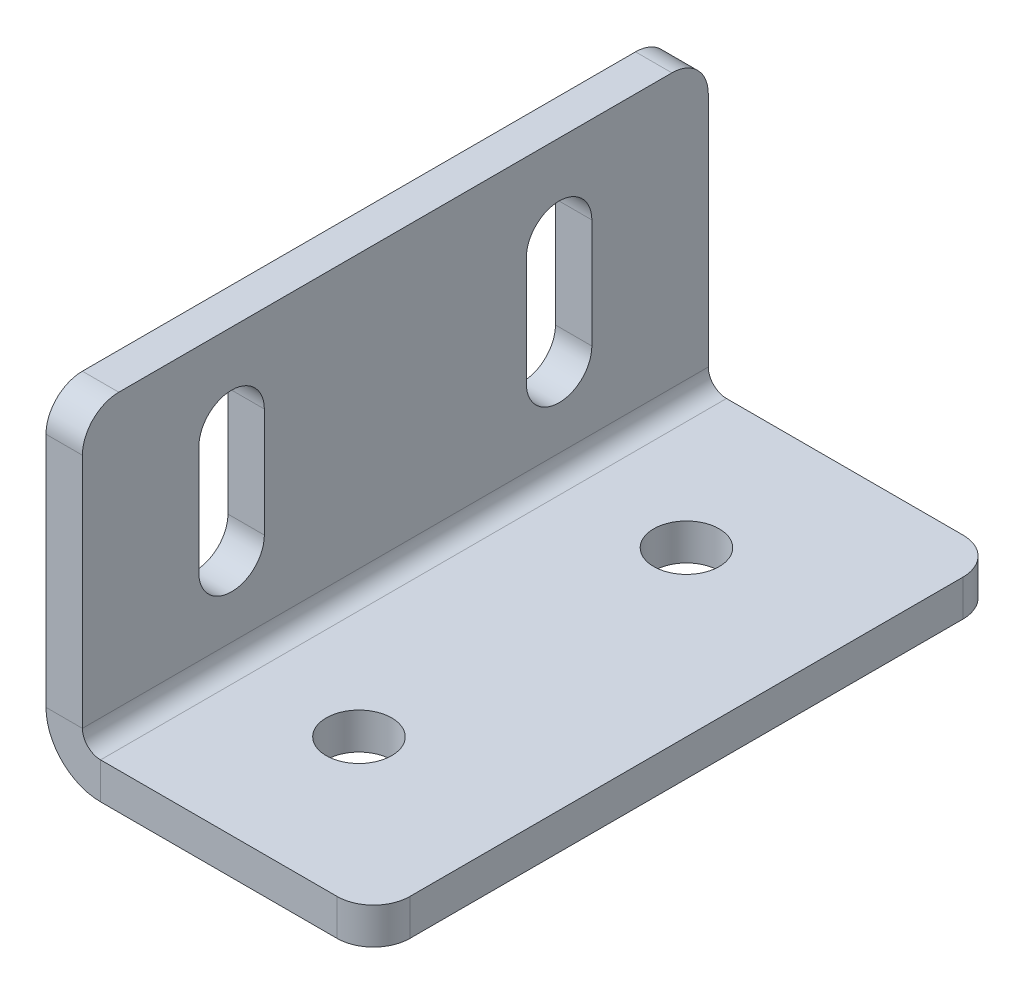
ISO-10303-21;
HEADER;
FILE_DESCRIPTION(('STEP AP214'),'2;1');
FILE_NAME('part.step','',(''),(''),'','','');
FILE_SCHEMA(('AUTOMOTIVE_DESIGN { 1 0 10303 214 1 1 1 1 }'));
ENDSEC;
DATA;
#1=APPLICATION_CONTEXT('core data for automotive mechanical design processes');
#2=APPLICATION_PROTOCOL_DEFINITION('international standard','automotive_design',2000,#1);
#3=PRODUCT_CONTEXT('',#1,'mechanical');
#4=PRODUCT('Part','Part','',(#3));
#5=PRODUCT_RELATED_PRODUCT_CATEGORY('part','',(#4));
#6=PRODUCT_DEFINITION_FORMATION('','',#4);
#7=PRODUCT_DEFINITION_CONTEXT('part definition',#1,'design');
#8=PRODUCT_DEFINITION('design','',#6,#7);
#9=PRODUCT_DEFINITION_SHAPE('','',#8);
#10=(LENGTH_UNIT() NAMED_UNIT(*) SI_UNIT(.MILLI.,.METRE.));
#11=(NAMED_UNIT(*) PLANE_ANGLE_UNIT() SI_UNIT($,.RADIAN.));
#12=(NAMED_UNIT(*) SI_UNIT($,.STERADIAN.) SOLID_ANGLE_UNIT());
#13=UNCERTAINTY_MEASURE_WITH_UNIT(LENGTH_MEASURE(1.E-05),#10,'distance_accuracy_value','');
#14=(GEOMETRIC_REPRESENTATION_CONTEXT(3) GLOBAL_UNCERTAINTY_ASSIGNED_CONTEXT((#13)) GLOBAL_UNIT_ASSIGNED_CONTEXT((#10,
#11,#12)) REPRESENTATION_CONTEXT('',''));
#15=CARTESIAN_POINT('',(0.,0.,0.));
#16=DIRECTION('',(0.,0.,1.));
#17=DIRECTION('',(1.,0.,0.));
#18=AXIS2_PLACEMENT_3D('',#15,#16,#17);
#19=CARTESIAN_POINT('',(0.,18.,-22.5));
#20=DIRECTION('',(-1.,0.,0.));
#21=DIRECTION('',(0.,0.,1.));
#22=AXIS2_PLACEMENT_3D('',#19,#20,#21);
#23=CYLINDRICAL_SURFACE('',#22,4.5);
#24=CARTESIAN_POINT('',(5.,18.,-22.5));
#25=DIRECTION('',(1.,0.,0.));
#26=DIRECTION('',(0.,0.,-1.));
#27=AXIS2_PLACEMENT_3D('',#24,#25,#26);
#28=CIRCLE('',#27,4.5);
#29=CARTESIAN_POINT('',(5.,18.,-18.));
#30=VERTEX_POINT('',#29);
#31=CARTESIAN_POINT('',(5.,18.,-27.));
#32=VERTEX_POINT('',#31);
#33=EDGE_CURVE('E351',#30,#32,#28,.T.);
#34=ORIENTED_EDGE('',*,*,#33,.T.);
#35=DIRECTION('',(1.,0.,0.));
#36=VECTOR('',#35,1.);
#37=CARTESIAN_POINT('',(0.,18.,-27.));
#38=LINE('',#37,#36);
#39=CARTESIAN_POINT('',(0.,18.,-27.));
#40=VERTEX_POINT('',#39);
#41=EDGE_CURVE('E255',#40,#32,#38,.T.);
#42=ORIENTED_EDGE('',*,*,#41,.F.);
#43=CARTESIAN_POINT('',(0.,18.,-22.5));
#44=DIRECTION('',(1.,0.,0.));
#45=DIRECTION('',(0.,0.,-1.));
#46=AXIS2_PLACEMENT_3D('',#43,#44,#45);
#47=CIRCLE('',#46,4.5);
#48=CARTESIAN_POINT('',(0.,18.,-18.));
#49=VERTEX_POINT('',#48);
#50=EDGE_CURVE('E264',#49,#40,#47,.T.);
#51=ORIENTED_EDGE('',*,*,#50,.F.);
#52=DIRECTION('',(1.,0.,0.));
#53=VECTOR('',#52,1.);
#54=CARTESIAN_POINT('',(0.,18.,-18.));
#55=LINE('',#54,#53);
#56=EDGE_CURVE('E258',#49,#30,#55,.T.);
#57=ORIENTED_EDGE('',*,*,#56,.T.);
#58=EDGE_LOOP('',(#34,#42,#51,#57));
#59=FACE_BOUND('',#58,.T.);
#60=ADVANCED_FACE('F46',(#59),#23,.F.);
#61=CARTESIAN_POINT('',(0.,18.,22.5));
#62=DIRECTION('',(-1.,0.,0.));
#63=DIRECTION('',(0.,0.,1.));
#64=AXIS2_PLACEMENT_3D('',#61,#62,#63);
#65=CYLINDRICAL_SURFACE('',#64,4.5);
#66=CARTESIAN_POINT('',(5.,18.,22.5));
#67=DIRECTION('',(1.,0.,0.));
#68=DIRECTION('',(0.,0.,-1.));
#69=AXIS2_PLACEMENT_3D('',#66,#67,#68);
#70=CIRCLE('',#69,4.5);
#71=CARTESIAN_POINT('',(5.,18.,27.));
#72=VERTEX_POINT('',#71);
#73=CARTESIAN_POINT('',(5.,18.,18.));
#74=VERTEX_POINT('',#73);
#75=EDGE_CURVE('E361',#72,#74,#70,.T.);
#76=ORIENTED_EDGE('',*,*,#75,.T.);
#77=DIRECTION('',(1.,0.,0.));
#78=VECTOR('',#77,1.);
#79=CARTESIAN_POINT('',(0.,18.,18.));
#80=LINE('',#79,#78);
#81=CARTESIAN_POINT('',(0.,18.,18.));
#82=VERTEX_POINT('',#81);
#83=EDGE_CURVE('E226',#82,#74,#80,.T.);
#84=ORIENTED_EDGE('',*,*,#83,.F.);
#85=CARTESIAN_POINT('',(0.,18.,22.5));
#86=DIRECTION('',(1.,0.,0.));
#87=DIRECTION('',(0.,0.,-1.));
#88=AXIS2_PLACEMENT_3D('',#85,#86,#87);
#89=CIRCLE('',#88,4.5);
#90=CARTESIAN_POINT('',(0.,18.,27.));
#91=VERTEX_POINT('',#90);
#92=EDGE_CURVE('E268',#91,#82,#89,.T.);
#93=ORIENTED_EDGE('',*,*,#92,.F.);
#94=DIRECTION('',(1.,0.,0.));
#95=VECTOR('',#94,1.);
#96=CARTESIAN_POINT('',(0.,18.,27.));
#97=LINE('',#96,#95);
#98=EDGE_CURVE('E191',#91,#72,#97,.T.);
#99=ORIENTED_EDGE('',*,*,#98,.T.);
#100=EDGE_LOOP('',(#76,#84,#93,#99));
#101=FACE_BOUND('',#100,.T.);
#102=ADVANCED_FACE('F507',(#101),#65,.F.);
#103=CARTESIAN_POINT('',(0.,0.,43.));
#104=DIRECTION('',(0.,0.,-1.));
#105=DIRECTION('',(0.,-1.,0.));
#106=AXIS2_PLACEMENT_3D('',#103,#104,#105);
#107=PLANE('',#106);
#108=DIRECTION('',(0.,1.,0.));
#109=VECTOR('',#108,1.);
#110=CARTESIAN_POINT('',(5.,0.,43.));
#111=LINE('',#110,#109);
#112=CARTESIAN_POINT('',(5.,40.,43.));
#113=VERTEX_POINT('',#112);
#114=CARTESIAN_POINT('',(5.,7.5,43.));
#115=VERTEX_POINT('',#114);
#116=EDGE_CURVE('E358',#113,#115,#111,.F.);
#117=ORIENTED_EDGE('',*,*,#116,.F.);
#118=DIRECTION('',(1.,0.,0.));
#119=VECTOR('',#118,1.);
#120=CARTESIAN_POINT('',(0.,40.,43.));
#121=LINE('',#120,#119);
#122=CARTESIAN_POINT('',(0.,40.,43.));
#123=VERTEX_POINT('',#122);
#124=EDGE_CURVE('E11',#113,#123,#121,.F.);
#125=ORIENTED_EDGE('',*,*,#124,.T.);
#126=DIRECTION('',(0.,-1.,0.));
#127=VECTOR('',#126,1.);
#128=CARTESIAN_POINT('',(0.,0.,43.));
#129=LINE('',#128,#127);
#130=CARTESIAN_POINT('',(0.,7.5,43.));
#131=VERTEX_POINT('',#130);
#132=EDGE_CURVE('E272',#123,#131,#129,.T.);
#133=ORIENTED_EDGE('',*,*,#132,.T.);
#134=DIRECTION('',(-1.,0.,0.));
#135=VECTOR('',#134,1.);
#136=CARTESIAN_POINT('',(0.,7.5,43.));
#137=LINE('',#136,#135);
#138=EDGE_CURVE('E378',#115,#131,#137,.T.);
#139=ORIENTED_EDGE('',*,*,#138,.F.);
#140=EDGE_LOOP('',(#117,#125,#133,#139));
#141=FACE_BOUND('',#140,.T.);
#142=ADVANCED_FACE('F464',(#141),#107,.F.);
#143=CARTESIAN_POINT('',(0.,45.,-43.));
#144=DIRECTION('',(0.,-1.,0.));
#145=DIRECTION('',(0.,0.,1.));
#146=AXIS2_PLACEMENT_3D('',#143,#144,#145);
#147=PLANE('',#146);
#148=DIRECTION('',(0.,0.,1.));
#149=VECTOR('',#148,1.);
#150=CARTESIAN_POINT('',(5.,45.,-43.));
#151=LINE('',#150,#149);
#152=CARTESIAN_POINT('',(5.,45.,-38.));
#153=VERTEX_POINT('',#152);
#154=CARTESIAN_POINT('',(5.,45.,38.));
#155=VERTEX_POINT('',#154);
#156=EDGE_CURVE('E354',#153,#155,#151,.T.);
#157=ORIENTED_EDGE('',*,*,#156,.F.);
#158=DIRECTION('',(-1.,0.,0.));
#159=VECTOR('',#158,1.);
#160=CARTESIAN_POINT('',(0.,45.,-38.));
#161=LINE('',#160,#159);
#162=CARTESIAN_POINT('',(0.,45.,-38.));
#163=VERTEX_POINT('',#162);
#164=EDGE_CURVE('E413',#153,#163,#161,.T.);
#165=ORIENTED_EDGE('',*,*,#164,.T.);
#166=DIRECTION('',(0.,0.,1.));
#167=VECTOR('',#166,1.);
#168=CARTESIAN_POINT('',(0.,45.,-43.));
#169=LINE('',#168,#167);
#170=CARTESIAN_POINT('',(0.,45.,38.));
#171=VERTEX_POINT('',#170);
#172=EDGE_CURVE('E275',#163,#171,#169,.T.);
#173=ORIENTED_EDGE('',*,*,#172,.T.);
#174=DIRECTION('',(1.,0.,0.));
#175=VECTOR('',#174,1.);
#176=CARTESIAN_POINT('',(0.,45.,38.));
#177=LINE('',#176,#175);
#178=EDGE_CURVE('E410',#171,#155,#177,.T.);
#179=ORIENTED_EDGE('',*,*,#178,.T.);
#180=EDGE_LOOP('',(#157,#165,#173,#179));
#181=FACE_BOUND('',#180,.T.);
#182=ADVANCED_FACE('F442',(#181),#147,.F.);
#183=CARTESIAN_POINT('',(0.,0.,-43.));
#184=DIRECTION('',(0.,0.,-1.));
#185=DIRECTION('',(0.,-1.,0.));
#186=AXIS2_PLACEMENT_3D('',#183,#184,#185);
#187=PLANE('',#186);
#188=DIRECTION('',(0.,-1.,0.));
#189=VECTOR('',#188,1.);
#190=CARTESIAN_POINT('',(0.,0.,-43.));
#191=LINE('',#190,#189);
#192=CARTESIAN_POINT('',(0.,40.,-43.));
#193=VERTEX_POINT('',#192);
#194=CARTESIAN_POINT('',(0.,7.5,-43.));
#195=VERTEX_POINT('',#194);
#196=EDGE_CURVE('E279',#193,#195,#191,.T.);
#197=ORIENTED_EDGE('',*,*,#196,.F.);
#198=DIRECTION('',(1.,0.,0.));
#199=VECTOR('',#198,1.);
#200=CARTESIAN_POINT('',(0.,40.,-43.));
#201=LINE('',#200,#199);
#202=CARTESIAN_POINT('',(5.,40.,-43.));
#203=VERTEX_POINT('',#202);
#204=EDGE_CURVE('E423',#193,#203,#201,.T.);
#205=ORIENTED_EDGE('',*,*,#204,.T.);
#206=DIRECTION('',(0.,1.,0.));
#207=VECTOR('',#206,1.);
#208=CARTESIAN_POINT('',(5.,0.,-43.));
#209=LINE('',#208,#207);
#210=CARTESIAN_POINT('',(5.,7.5,-43.));
#211=VERTEX_POINT('',#210);
#212=EDGE_CURVE('E332',#203,#211,#209,.F.);
#213=ORIENTED_EDGE('',*,*,#212,.T.);
#214=DIRECTION('',(-1.,0.,0.));
#215=VECTOR('',#214,1.);
#216=CARTESIAN_POINT('',(0.,7.5,-43.));
#217=LINE('',#216,#215);
#218=EDGE_CURVE('E374',#211,#195,#217,.T.);
#219=ORIENTED_EDGE('',*,*,#218,.T.);
#220=EDGE_LOOP('',(#197,#205,#213,#219));
#221=FACE_BOUND('',#220,.T.);
#222=ADVANCED_FACE('F449',(#221),#187,.T.);
#223=CARTESIAN_POINT('',(7.5,7.5,-43.));
#224=DIRECTION('',(0.,0.,1.));
#225=DIRECTION('',(1.,0.,0.));
#226=AXIS2_PLACEMENT_3D('',#223,#224,#225);
#227=PLANE('',#226);
#228=ORIENTED_EDGE('',*,*,#218,.F.);
#229=CARTESIAN_POINT('',(7.5,7.5,-43.));
#230=DIRECTION('',(0.,0.,1.));
#231=DIRECTION('',(1.,0.,0.));
#232=AXIS2_PLACEMENT_3D('',#229,#230,#231);
#233=CIRCLE('',#232,2.5);
#234=CARTESIAN_POINT('',(7.5,5.,-43.));
#235=VERTEX_POINT('',#234);
#236=EDGE_CURVE('E347',#211,#235,#233,.T.);
#237=ORIENTED_EDGE('',*,*,#236,.T.);
#238=DIRECTION('',(0.,-1.,0.));
#239=VECTOR('',#238,1.);
#240=CARTESIAN_POINT('',(7.50000000000001,0.,-43.));
#241=LINE('',#240,#239);
#242=CARTESIAN_POINT('',(7.50000000000001,0.,-43.));
#243=VERTEX_POINT('',#242);
#244=EDGE_CURVE('E371',#235,#243,#241,.T.);
#245=ORIENTED_EDGE('',*,*,#244,.T.);
#246=CARTESIAN_POINT('',(7.5,7.5,-43.));
#247=DIRECTION('',(0.,0.,-1.));
#248=DIRECTION('',(-1.,0.,0.));
#249=AXIS2_PLACEMENT_3D('',#246,#247,#248);
#250=CIRCLE('',#249,7.5);
#251=EDGE_CURVE('E269',#195,#243,#250,.F.);
#252=ORIENTED_EDGE('',*,*,#251,.F.);
#253=EDGE_LOOP('',(#228,#237,#245,#252));
#254=FACE_BOUND('',#253,.T.);
#255=ADVANCED_FACE('F454',(#254),#227,.F.);
#256=CARTESIAN_POINT('',(45.,0.,-43.));
#257=DIRECTION('',(0.,0.,-1.));
#258=DIRECTION('',(1.,0.,0.));
#259=AXIS2_PLACEMENT_3D('',#256,#257,#258);
#260=PLANE('',#259);
#261=DIRECTION('',(1.,0.,0.));
#262=VECTOR('',#261,1.);
#263=CARTESIAN_POINT('',(45.,5.,-43.));
#264=LINE('',#263,#262);
#265=CARTESIAN_POINT('',(40.,5.,-43.));
#266=VERTEX_POINT('',#265);
#267=EDGE_CURVE('E326',#235,#266,#264,.T.);
#268=ORIENTED_EDGE('',*,*,#267,.T.);
#269=DIRECTION('',(0.,-1.,0.));
#270=VECTOR('',#269,1.);
#271=CARTESIAN_POINT('',(40.,0.,-43.));
#272=LINE('',#271,#270);
#273=CARTESIAN_POINT('',(40.,0.,-43.));
#274=VERTEX_POINT('',#273);
#275=EDGE_CURVE('E382',#266,#274,#272,.T.);
#276=ORIENTED_EDGE('',*,*,#275,.T.);
#277=DIRECTION('',(1.,0.,0.));
#278=VECTOR('',#277,1.);
#279=CARTESIAN_POINT('',(45.,0.,-43.));
#280=LINE('',#279,#278);
#281=EDGE_CURVE('E298',#243,#274,#280,.T.);
#282=ORIENTED_EDGE('',*,*,#281,.F.);
#283=ORIENTED_EDGE('',*,*,#244,.F.);
#284=EDGE_LOOP('',(#268,#276,#282,#283));
#285=FACE_BOUND('',#284,.T.);
#286=ADVANCED_FACE('F497',(#285),#260,.T.);
#287=CARTESIAN_POINT('',(45.,0.,-43.));
#288=DIRECTION('',(1.,0.,0.));
#289=DIRECTION('',(0.,0.,1.));
#290=AXIS2_PLACEMENT_3D('',#287,#288,#289);
#291=PLANE('',#290);
#292=DIRECTION('',(0.,0.,1.));
#293=VECTOR('',#292,1.);
#294=CARTESIAN_POINT('',(45.,0.,-43.));
#295=LINE('',#294,#293);
#296=CARTESIAN_POINT('',(45.,0.,-38.));
#297=VERTEX_POINT('',#296);
#298=CARTESIAN_POINT('',(45.,0.,38.));
#299=VERTEX_POINT('',#298);
#300=EDGE_CURVE('E290',#297,#299,#295,.T.);
#301=ORIENTED_EDGE('',*,*,#300,.F.);
#302=DIRECTION('',(0.,-1.,0.));
#303=VECTOR('',#302,1.);
#304=CARTESIAN_POINT('',(45.,0.,-38.));
#305=LINE('',#304,#303);
#306=CARTESIAN_POINT('',(45.,5.,-38.));
#307=VERTEX_POINT('',#306);
#308=EDGE_CURVE('E398',#297,#307,#305,.F.);
#309=ORIENTED_EDGE('',*,*,#308,.T.);
#310=DIRECTION('',(0.,0.,1.));
#311=VECTOR('',#310,1.);
#312=CARTESIAN_POINT('',(45.,5.,-43.));
#313=LINE('',#312,#311);
#314=CARTESIAN_POINT('',(45.,5.,38.));
#315=VERTEX_POINT('',#314);
#316=EDGE_CURVE('E336',#307,#315,#313,.T.);
#317=ORIENTED_EDGE('',*,*,#316,.T.);
#318=DIRECTION('',(0.,1.,0.));
#319=VECTOR('',#318,1.);
#320=CARTESIAN_POINT('',(45.,0.,38.));
#321=LINE('',#320,#319);
#322=EDGE_CURVE('E394',#315,#299,#321,.F.);
#323=ORIENTED_EDGE('',*,*,#322,.T.);
#324=EDGE_LOOP('',(#301,#309,#317,#323));
#325=FACE_BOUND('',#324,.T.);
#326=ADVANCED_FACE('F488',(#325),#291,.T.);
#327=CARTESIAN_POINT('',(45.,0.,43.));
#328=DIRECTION('',(0.,0.,-1.));
#329=DIRECTION('',(1.,0.,0.));
#330=AXIS2_PLACEMENT_3D('',#327,#328,#329);
#331=PLANE('',#330);
#332=DIRECTION('',(1.,0.,0.));
#333=VECTOR('',#332,1.);
#334=CARTESIAN_POINT('',(45.,0.,43.));
#335=LINE('',#334,#333);
#336=CARTESIAN_POINT('',(7.50000000000001,0.,43.));
#337=VERTEX_POINT('',#336);
#338=CARTESIAN_POINT('',(40.,0.,43.));
#339=VERTEX_POINT('',#338);
#340=EDGE_CURVE('E294',#337,#339,#335,.T.);
#341=ORIENTED_EDGE('',*,*,#340,.T.);
#342=DIRECTION('',(0.,-1.,0.));
#343=VECTOR('',#342,1.);
#344=CARTESIAN_POINT('',(40.,0.,43.));
#345=LINE('',#344,#343);
#346=CARTESIAN_POINT('',(40.,5.,43.));
#347=VERTEX_POINT('',#346);
#348=EDGE_CURVE('E407',#339,#347,#345,.F.);
#349=ORIENTED_EDGE('',*,*,#348,.T.);
#350=DIRECTION('',(1.,0.,0.));
#351=VECTOR('',#350,1.);
#352=CARTESIAN_POINT('',(45.,5.,43.));
#353=LINE('',#352,#351);
#354=CARTESIAN_POINT('',(7.50000000000001,5.,43.));
#355=VERTEX_POINT('',#354);
#356=EDGE_CURVE('E337',#355,#347,#353,.T.);
#357=ORIENTED_EDGE('',*,*,#356,.F.);
#358=DIRECTION('',(0.,-1.,0.));
#359=VECTOR('',#358,1.);
#360=CARTESIAN_POINT('',(7.50000000000001,0.,43.));
#361=LINE('',#360,#359);
#362=EDGE_CURVE('E310',#355,#337,#361,.T.);
#363=ORIENTED_EDGE('',*,*,#362,.T.);
#364=EDGE_LOOP('',(#341,#349,#357,#363));
#365=FACE_BOUND('',#364,.T.);
#366=ADVANCED_FACE('F475',(#365),#331,.F.);
#367=CARTESIAN_POINT('',(22.5,0.,-22.5));
#368=DIRECTION('',(0.,-1.,0.));
#369=DIRECTION('',(1.,0.,0.));
#370=AXIS2_PLACEMENT_3D('',#367,#368,#369);
#371=CYLINDRICAL_SURFACE('',#370,4.49999999999999);
#372=CARTESIAN_POINT('',(22.5,0.,-22.5));
#373=DIRECTION('',(0.,-1.,0.));
#374=DIRECTION('',(0.,0.,-1.));
#375=AXIS2_PLACEMENT_3D('',#372,#373,#374);
#376=CIRCLE('',#375,4.49999999999999);
#377=CARTESIAN_POINT('',(22.5,0.,-27.));
#378=VERTEX_POINT('',#377);
#379=EDGE_CURVE('E282',#378,#378,#376,.T.);
#380=ORIENTED_EDGE('',*,*,#379,.T.);
#381=EDGE_LOOP('',(#380));
#382=FACE_BOUND('',#381,.T.);
#383=CARTESIAN_POINT('',(22.5,5.,-22.5));
#384=DIRECTION('',(0.,-1.,0.));
#385=DIRECTION('',(0.,0.,-1.));
#386=AXIS2_PLACEMENT_3D('',#383,#384,#385);
#387=CIRCLE('',#386,4.49999999999999);
#388=CARTESIAN_POINT('',(22.5,5.,-27.));
#389=VERTEX_POINT('',#388);
#390=EDGE_CURVE('E327',#389,#389,#387,.T.);
#391=ORIENTED_EDGE('',*,*,#390,.F.);
#392=EDGE_LOOP('',(#391));
#393=FACE_BOUND('',#392,.T.);
#394=ADVANCED_FACE('F555',(#382,#393),#371,.F.);
#395=CARTESIAN_POINT('',(22.5,0.,22.5));
#396=DIRECTION('',(0.,-1.,0.));
#397=DIRECTION('',(1.,0.,0.));
#398=AXIS2_PLACEMENT_3D('',#395,#396,#397);
#399=CYLINDRICAL_SURFACE('',#398,4.49999999999999);
#400=CARTESIAN_POINT('',(22.5,0.,22.5));
#401=DIRECTION('',(0.,-1.,0.));
#402=DIRECTION('',(0.,0.,-1.));
#403=AXIS2_PLACEMENT_3D('',#400,#401,#402);
#404=CIRCLE('',#403,4.49999999999999);
#405=CARTESIAN_POINT('',(22.5,0.,18.));
#406=VERTEX_POINT('',#405);
#407=EDGE_CURVE('E286',#406,#406,#404,.T.);
#408=ORIENTED_EDGE('',*,*,#407,.T.);
#409=EDGE_LOOP('',(#408));
#410=FACE_BOUND('',#409,.T.);
#411=CARTESIAN_POINT('',(22.5,5.,22.5));
#412=DIRECTION('',(0.,-1.,0.));
#413=DIRECTION('',(0.,0.,-1.));
#414=AXIS2_PLACEMENT_3D('',#411,#412,#413);
#415=CIRCLE('',#414,4.49999999999999);
#416=CARTESIAN_POINT('',(22.5,5.,18.));
#417=VERTEX_POINT('',#416);
#418=EDGE_CURVE('E331',#417,#417,#415,.T.);
#419=ORIENTED_EDGE('',*,*,#418,.F.);
#420=EDGE_LOOP('',(#419));
#421=FACE_BOUND('',#420,.T.);
#422=ADVANCED_FACE('F558',(#410,#421),#399,.F.);
#423=CARTESIAN_POINT('',(7.5,7.5,43.));
#424=DIRECTION('',(0.,0.,-1.));
#425=DIRECTION('',(-1.,0.,0.));
#426=AXIS2_PLACEMENT_3D('',#423,#424,#425);
#427=PLANE('',#426);
#428=CARTESIAN_POINT('',(7.5,7.5,43.));
#429=DIRECTION('',(0.,0.,1.));
#430=DIRECTION('',(1.,0.,0.));
#431=AXIS2_PLACEMENT_3D('',#428,#429,#430);
#432=CIRCLE('',#431,2.5);
#433=EDGE_CURVE('E225',#355,#115,#432,.F.);
#434=ORIENTED_EDGE('',*,*,#433,.T.);
#435=ORIENTED_EDGE('',*,*,#138,.T.);
#436=CARTESIAN_POINT('',(7.5,7.5,43.));
#437=DIRECTION('',(0.,0.,1.));
#438=DIRECTION('',(1.,0.,0.));
#439=AXIS2_PLACEMENT_3D('',#436,#437,#438);
#440=CIRCLE('',#439,7.5);
#441=EDGE_CURVE('E311',#337,#131,#440,.F.);
#442=ORIENTED_EDGE('',*,*,#441,.F.);
#443=ORIENTED_EDGE('',*,*,#362,.F.);
#444=EDGE_LOOP('',(#434,#435,#442,#443));
#445=FACE_BOUND('',#444,.T.);
#446=ADVANCED_FACE('F467',(#445),#427,.F.);
#447=CARTESIAN_POINT('',(45.,0.,-43.));
#448=DIRECTION('',(0.,-1.,0.));
#449=DIRECTION('',(1.,0.,0.));
#450=AXIS2_PLACEMENT_3D('',#447,#448,#449);
#451=PLANE('',#450);
#452=ORIENTED_EDGE('',*,*,#379,.F.);
#453=EDGE_LOOP('',(#452));
#454=FACE_BOUND('',#453,.T.);
#455=ORIENTED_EDGE('',*,*,#407,.F.);
#456=EDGE_LOOP('',(#455));
#457=FACE_BOUND('',#456,.T.);
#458=ORIENTED_EDGE('',*,*,#281,.T.);
#459=CARTESIAN_POINT('',(40.,0.,-38.));
#460=DIRECTION('',(0.,-1.,0.));
#461=DIRECTION('',(1.,0.,0.));
#462=AXIS2_PLACEMENT_3D('',#459,#460,#461);
#463=CIRCLE('',#462,5.);
#464=EDGE_CURVE('E391',#274,#297,#463,.T.);
#465=ORIENTED_EDGE('',*,*,#464,.T.);
#466=ORIENTED_EDGE('',*,*,#300,.T.);
#467=CARTESIAN_POINT('',(40.,0.,38.));
#468=DIRECTION('',(0.,-1.,0.));
#469=DIRECTION('',(1.,0.,0.));
#470=AXIS2_PLACEMENT_3D('',#467,#468,#469);
#471=CIRCLE('',#470,5.);
#472=EDGE_CURVE('E388',#299,#339,#471,.T.);
#473=ORIENTED_EDGE('',*,*,#472,.T.);
#474=ORIENTED_EDGE('',*,*,#340,.F.);
#475=DIRECTION('',(0.,0.,1.));
#476=VECTOR('',#475,1.);
#477=CARTESIAN_POINT('',(7.5,0.,-43.));
#478=LINE('',#477,#476);
#479=EDGE_CURVE('E306',#337,#243,#478,.F.);
#480=ORIENTED_EDGE('',*,*,#479,.T.);
#481=EDGE_LOOP('',(#458,#465,#466,#473,#474,#480));
#482=FACE_BOUND('',#481,.T.);
#483=ADVANCED_FACE('F491',(#454,#457,#482),#451,.T.);
#484=CARTESIAN_POINT('',(0.,0.,-43.));
#485=DIRECTION('',(-1.,0.,0.));
#486=DIRECTION('',(0.,0.,1.));
#487=AXIS2_PLACEMENT_3D('',#484,#485,#486);
#488=PLANE('',#487);
#489=DIRECTION('',(0.,1.,0.));
#490=VECTOR('',#489,1.);
#491=CARTESIAN_POINT('',(0.,33.,18.));
#492=LINE('',#491,#490);
#493=CARTESIAN_POINT('',(0.,33.,18.));
#494=VERTEX_POINT('',#493);
#495=EDGE_CURVE('E192',#82,#494,#492,.T.);
#496=ORIENTED_EDGE('',*,*,#495,.T.);
#497=CARTESIAN_POINT('',(0.,33.,22.5));
#498=DIRECTION('',(1.,0.,0.));
#499=DIRECTION('',(0.,0.,-1.));
#500=AXIS2_PLACEMENT_3D('',#497,#498,#499);
#501=CIRCLE('',#500,4.49999999999999);
#502=CARTESIAN_POINT('',(0.,33.,27.));
#503=VERTEX_POINT('',#502);
#504=EDGE_CURVE('E186',#494,#503,#501,.T.);
#505=ORIENTED_EDGE('',*,*,#504,.T.);
#506=DIRECTION('',(0.,-1.,0.));
#507=VECTOR('',#506,1.);
#508=CARTESIAN_POINT('',(0.,33.,27.));
#509=LINE('',#508,#507);
#510=EDGE_CURVE('E195',#503,#91,#509,.T.);
#511=ORIENTED_EDGE('',*,*,#510,.T.);
#512=ORIENTED_EDGE('',*,*,#92,.T.);
#513=EDGE_LOOP('',(#496,#505,#511,#512));
#514=FACE_BOUND('',#513,.T.);
#515=DIRECTION('',(0.,1.,0.));
#516=VECTOR('',#515,1.);
#517=CARTESIAN_POINT('',(0.,33.,-27.));
#518=LINE('',#517,#516);
#519=CARTESIAN_POINT('',(0.,33.,-27.));
#520=VERTEX_POINT('',#519);
#521=EDGE_CURVE('E240',#40,#520,#518,.T.);
#522=ORIENTED_EDGE('',*,*,#521,.T.);
#523=CARTESIAN_POINT('',(0.,33.,-22.5));
#524=DIRECTION('',(1.,0.,0.));
#525=DIRECTION('',(0.,0.,-1.));
#526=AXIS2_PLACEMENT_3D('',#523,#524,#525);
#527=CIRCLE('',#526,4.49999999999999);
#528=CARTESIAN_POINT('',(0.,33.,-18.));
#529=VERTEX_POINT('',#528);
#530=EDGE_CURVE('E231',#520,#529,#527,.T.);
#531=ORIENTED_EDGE('',*,*,#530,.T.);
#532=DIRECTION('',(0.,-1.,0.));
#533=VECTOR('',#532,1.);
#534=CARTESIAN_POINT('',(0.,33.,-18.));
#535=LINE('',#534,#533);
#536=EDGE_CURVE('E235',#529,#49,#535,.T.);
#537=ORIENTED_EDGE('',*,*,#536,.T.);
#538=ORIENTED_EDGE('',*,*,#50,.T.);
#539=EDGE_LOOP('',(#522,#531,#537,#538));
#540=FACE_BOUND('',#539,.T.);
#541=ORIENTED_EDGE('',*,*,#172,.F.);
#542=CARTESIAN_POINT('',(0.,40.,-38.));
#543=DIRECTION('',(-1.,0.,0.));
#544=DIRECTION('',(0.,0.,1.));
#545=AXIS2_PLACEMENT_3D('',#542,#543,#544);
#546=CIRCLE('',#545,5.);
#547=EDGE_CURVE('E420',#163,#193,#546,.T.);
#548=ORIENTED_EDGE('',*,*,#547,.T.);
#549=ORIENTED_EDGE('',*,*,#196,.T.);
#550=DIRECTION('',(0.,0.,1.));
#551=VECTOR('',#550,1.);
#552=CARTESIAN_POINT('',(0.,7.5,-43.));
#553=LINE('',#552,#551);
#554=EDGE_CURVE('E302',#195,#131,#553,.T.);
#555=ORIENTED_EDGE('',*,*,#554,.T.);
#556=ORIENTED_EDGE('',*,*,#132,.F.);
#557=CARTESIAN_POINT('',(0.,40.,38.));
#558=DIRECTION('',(-1.,0.,0.));
#559=DIRECTION('',(0.,0.,1.));
#560=AXIS2_PLACEMENT_3D('',#557,#558,#559);
#561=CIRCLE('',#560,5.);
#562=EDGE_CURVE('E417',#123,#171,#561,.T.);
#563=ORIENTED_EDGE('',*,*,#562,.T.);
#564=EDGE_LOOP('',(#541,#548,#549,#555,#556,#563));
#565=FACE_BOUND('',#564,.T.);
#566=ADVANCED_FACE('F203',(#514,#540,#565),#488,.T.);
#567=CARTESIAN_POINT('',(7.5,7.5,-43.));
#568=DIRECTION('',(0.,0.,1.));
#569=DIRECTION('',(1.,0.,0.));
#570=AXIS2_PLACEMENT_3D('',#567,#568,#569);
#571=CYLINDRICAL_SURFACE('',#570,7.5);
#572=ORIENTED_EDGE('',*,*,#251,.T.);
#573=ORIENTED_EDGE('',*,*,#479,.F.);
#574=ORIENTED_EDGE('',*,*,#441,.T.);
#575=ORIENTED_EDGE('',*,*,#554,.F.);
#576=EDGE_LOOP('',(#572,#573,#574,#575));
#577=FACE_BOUND('',#576,.T.);
#578=ADVANCED_FACE('F458',(#577),#571,.T.);
#579=CARTESIAN_POINT('',(45.,5.,-43.));
#580=DIRECTION('',(0.,-1.,0.));
#581=DIRECTION('',(1.,0.,0.));
#582=AXIS2_PLACEMENT_3D('',#579,#580,#581);
#583=PLANE('',#582);
#584=ORIENTED_EDGE('',*,*,#390,.T.);
#585=EDGE_LOOP('',(#584));
#586=FACE_BOUND('',#585,.T.);
#587=ORIENTED_EDGE('',*,*,#418,.T.);
#588=EDGE_LOOP('',(#587));
#589=FACE_BOUND('',#588,.T.);
#590=ORIENTED_EDGE('',*,*,#316,.F.);
#591=CARTESIAN_POINT('',(40.,5.,-38.));
#592=DIRECTION('',(0.,-1.,0.));
#593=DIRECTION('',(1.,0.,0.));
#594=AXIS2_PLACEMENT_3D('',#591,#592,#593);
#595=CIRCLE('',#594,5.);
#596=EDGE_CURVE('E404',#307,#266,#595,.F.);
#597=ORIENTED_EDGE('',*,*,#596,.T.);
#598=ORIENTED_EDGE('',*,*,#267,.F.);
#599=DIRECTION('',(0.,0.,1.));
#600=VECTOR('',#599,1.);
#601=CARTESIAN_POINT('',(7.50000000000001,5.,-43.));
#602=LINE('',#601,#600);
#603=EDGE_CURVE('E315',#355,#235,#602,.F.);
#604=ORIENTED_EDGE('',*,*,#603,.F.);
#605=ORIENTED_EDGE('',*,*,#356,.T.);
#606=CARTESIAN_POINT('',(40.,5.,38.));
#607=DIRECTION('',(0.,-1.,0.));
#608=DIRECTION('',(1.,0.,0.));
#609=AXIS2_PLACEMENT_3D('',#606,#607,#608);
#610=CIRCLE('',#609,5.);
#611=EDGE_CURVE('E401',#347,#315,#610,.F.);
#612=ORIENTED_EDGE('',*,*,#611,.T.);
#613=EDGE_LOOP('',(#590,#597,#598,#604,#605,#612));
#614=FACE_BOUND('',#613,.T.);
#615=ADVANCED_FACE('F481',(#586,#589,#614),#583,.F.);
#616=CARTESIAN_POINT('',(5.,0.,-43.));
#617=DIRECTION('',(-1.,0.,0.));
#618=DIRECTION('',(0.,0.,1.));
#619=AXIS2_PLACEMENT_3D('',#616,#617,#618);
#620=PLANE('',#619);
#621=CARTESIAN_POINT('',(5.,33.,-22.5));
#622=DIRECTION('',(1.,0.,0.));
#623=DIRECTION('',(0.,0.,-1.));
#624=AXIS2_PLACEMENT_3D('',#621,#622,#623);
#625=CIRCLE('',#624,4.49999999999999);
#626=CARTESIAN_POINT('',(5.,33.,-27.));
#627=VERTEX_POINT('',#626);
#628=CARTESIAN_POINT('',(5.,33.,-18.));
#629=VERTEX_POINT('',#628);
#630=EDGE_CURVE('E70',#627,#629,#625,.T.);
#631=ORIENTED_EDGE('',*,*,#630,.F.);
#632=DIRECTION('',(0.,1.,0.));
#633=VECTOR('',#632,1.);
#634=CARTESIAN_POINT('',(5.,33.,-27.));
#635=LINE('',#634,#633);
#636=EDGE_CURVE('E236',#32,#627,#635,.T.);
#637=ORIENTED_EDGE('',*,*,#636,.F.);
#638=ORIENTED_EDGE('',*,*,#33,.F.);
#639=DIRECTION('',(0.,-1.,0.));
#640=VECTOR('',#639,1.);
#641=CARTESIAN_POINT('',(5.,33.,-18.));
#642=LINE('',#641,#640);
#643=EDGE_CURVE('E247',#629,#30,#642,.T.);
#644=ORIENTED_EDGE('',*,*,#643,.F.);
#645=EDGE_LOOP('',(#631,#637,#638,#644));
#646=FACE_BOUND('',#645,.T.);
#647=CARTESIAN_POINT('',(5.,33.,22.5));
#648=DIRECTION('',(1.,0.,0.));
#649=DIRECTION('',(0.,0.,-1.));
#650=AXIS2_PLACEMENT_3D('',#647,#648,#649);
#651=CIRCLE('',#650,4.49999999999999);
#652=CARTESIAN_POINT('',(5.,33.,18.));
#653=VERTEX_POINT('',#652);
#654=CARTESIAN_POINT('',(5.,33.,27.));
#655=VERTEX_POINT('',#654);
#656=EDGE_CURVE('E62',#653,#655,#651,.T.);
#657=ORIENTED_EDGE('',*,*,#656,.F.);
#658=DIRECTION('',(0.,1.,0.));
#659=VECTOR('',#658,1.);
#660=CARTESIAN_POINT('',(5.,33.,18.));
#661=LINE('',#660,#659);
#662=EDGE_CURVE('E206',#74,#653,#661,.T.);
#663=ORIENTED_EDGE('',*,*,#662,.F.);
#664=ORIENTED_EDGE('',*,*,#75,.F.);
#665=DIRECTION('',(0.,-1.,0.));
#666=VECTOR('',#665,1.);
#667=CARTESIAN_POINT('',(5.,33.,27.));
#668=LINE('',#667,#666);
#669=EDGE_CURVE('E212',#655,#72,#668,.T.);
#670=ORIENTED_EDGE('',*,*,#669,.F.);
#671=EDGE_LOOP('',(#657,#663,#664,#670));
#672=FACE_BOUND('',#671,.T.);
#673=ORIENTED_EDGE('',*,*,#212,.F.);
#674=CARTESIAN_POINT('',(5.,40.,-38.));
#675=DIRECTION('',(-1.,0.,0.));
#676=DIRECTION('',(0.,0.,1.));
#677=AXIS2_PLACEMENT_3D('',#674,#675,#676);
#678=CIRCLE('',#677,5.);
#679=EDGE_CURVE('E55',#203,#153,#678,.F.);
#680=ORIENTED_EDGE('',*,*,#679,.T.);
#681=ORIENTED_EDGE('',*,*,#156,.T.);
#682=CARTESIAN_POINT('',(5.,40.,38.));
#683=DIRECTION('',(-1.,0.,0.));
#684=DIRECTION('',(0.,0.,1.));
#685=AXIS2_PLACEMENT_3D('',#682,#683,#684);
#686=CIRCLE('',#685,5.);
#687=EDGE_CURVE('E426',#155,#113,#686,.F.);
#688=ORIENTED_EDGE('',*,*,#687,.T.);
#689=ORIENTED_EDGE('',*,*,#116,.T.);
#690=DIRECTION('',(0.,0.,1.));
#691=VECTOR('',#690,1.);
#692=CARTESIAN_POINT('',(5.,7.5,-43.));
#693=LINE('',#692,#691);
#694=EDGE_CURVE('E322',#211,#115,#693,.T.);
#695=ORIENTED_EDGE('',*,*,#694,.F.);
#696=EDGE_LOOP('',(#673,#680,#681,#688,#689,#695));
#697=FACE_BOUND('',#696,.T.);
#698=ADVANCED_FACE('F435',(#646,#672,#697),#620,.F.);
#699=CARTESIAN_POINT('',(7.5,7.5,-43.));
#700=DIRECTION('',(0.,0.,1.));
#701=DIRECTION('',(1.,0.,0.));
#702=AXIS2_PLACEMENT_3D('',#699,#700,#701);
#703=CYLINDRICAL_SURFACE('',#702,2.5);
#704=ORIENTED_EDGE('',*,*,#236,.F.);
#705=ORIENTED_EDGE('',*,*,#694,.T.);
#706=ORIENTED_EDGE('',*,*,#433,.F.);
#707=ORIENTED_EDGE('',*,*,#603,.T.);
#708=EDGE_LOOP('',(#704,#705,#706,#707));
#709=FACE_BOUND('',#708,.T.);
#710=ADVANCED_FACE('F473',(#709),#703,.F.);
#711=CARTESIAN_POINT('',(40.,0.,-38.));
#712=DIRECTION('',(0.,-1.,0.));
#713=DIRECTION('',(1.,0.,0.));
#714=AXIS2_PLACEMENT_3D('',#711,#712,#713);
#715=CYLINDRICAL_SURFACE('',#714,5.);
#716=ORIENTED_EDGE('',*,*,#596,.F.);
#717=ORIENTED_EDGE('',*,*,#308,.F.);
#718=ORIENTED_EDGE('',*,*,#464,.F.);
#719=ORIENTED_EDGE('',*,*,#275,.F.);
#720=EDGE_LOOP('',(#716,#717,#718,#719));
#721=FACE_BOUND('',#720,.T.);
#722=ADVANCED_FACE('F495',(#721),#715,.T.);
#723=CARTESIAN_POINT('',(40.,0.,38.));
#724=DIRECTION('',(0.,1.,0.));
#725=DIRECTION('',(-1.,0.,0.));
#726=AXIS2_PLACEMENT_3D('',#723,#724,#725);
#727=CYLINDRICAL_SURFACE('',#726,5.);
#728=ORIENTED_EDGE('',*,*,#611,.F.);
#729=ORIENTED_EDGE('',*,*,#348,.F.);
#730=ORIENTED_EDGE('',*,*,#472,.F.);
#731=ORIENTED_EDGE('',*,*,#322,.F.);
#732=EDGE_LOOP('',(#728,#729,#730,#731));
#733=FACE_BOUND('',#732,.T.);
#734=ADVANCED_FACE('F485',(#733),#727,.T.);
#735=CARTESIAN_POINT('',(0.,40.,-38.));
#736=DIRECTION('',(1.,0.,0.));
#737=DIRECTION('',(0.,0.,-1.));
#738=AXIS2_PLACEMENT_3D('',#735,#736,#737);
#739=CYLINDRICAL_SURFACE('',#738,5.);
#740=ORIENTED_EDGE('',*,*,#679,.F.);
#741=ORIENTED_EDGE('',*,*,#204,.F.);
#742=ORIENTED_EDGE('',*,*,#547,.F.);
#743=ORIENTED_EDGE('',*,*,#164,.F.);
#744=EDGE_LOOP('',(#740,#741,#742,#743));
#745=FACE_BOUND('',#744,.T.);
#746=ADVANCED_FACE('F445',(#745),#739,.T.);
#747=CARTESIAN_POINT('',(0.,40.,38.));
#748=DIRECTION('',(-1.,0.,0.));
#749=DIRECTION('',(0.,0.,1.));
#750=AXIS2_PLACEMENT_3D('',#747,#748,#749);
#751=CYLINDRICAL_SURFACE('',#750,5.);
#752=ORIENTED_EDGE('',*,*,#687,.F.);
#753=ORIENTED_EDGE('',*,*,#178,.F.);
#754=ORIENTED_EDGE('',*,*,#562,.F.);
#755=ORIENTED_EDGE('',*,*,#124,.F.);
#756=EDGE_LOOP('',(#752,#753,#754,#755));
#757=FACE_BOUND('',#756,.T.);
#758=ADVANCED_FACE('F48',(#757),#751,.T.);
#759=CARTESIAN_POINT('',(0.,33.,-22.5));
#760=DIRECTION('',(1.,0.,0.));
#761=DIRECTION('',(0.,0.,-1.));
#762=AXIS2_PLACEMENT_3D('',#759,#760,#761);
#763=CYLINDRICAL_SURFACE('',#762,4.49999999999999);
#764=ORIENTED_EDGE('',*,*,#630,.T.);
#765=DIRECTION('',(1.,0.,0.));
#766=VECTOR('',#765,1.);
#767=CARTESIAN_POINT('',(0.,33.,-18.));
#768=LINE('',#767,#766);
#769=EDGE_CURVE('E244',#529,#629,#768,.T.);
#770=ORIENTED_EDGE('',*,*,#769,.F.);
#771=ORIENTED_EDGE('',*,*,#530,.F.);
#772=DIRECTION('',(1.,0.,0.));
#773=VECTOR('',#772,1.);
#774=CARTESIAN_POINT('',(0.,33.,-27.));
#775=LINE('',#774,#773);
#776=EDGE_CURVE('E219',#520,#627,#775,.T.);
#777=ORIENTED_EDGE('',*,*,#776,.T.);
#778=EDGE_LOOP('',(#764,#770,#771,#777));
#779=FACE_BOUND('',#778,.T.);
#780=ADVANCED_FACE('F525',(#779),#763,.F.);
#781=CARTESIAN_POINT('',(0.,33.,-27.));
#782=DIRECTION('',(0.,0.,-1.));
#783=DIRECTION('',(0.,1.,0.));
#784=AXIS2_PLACEMENT_3D('',#781,#782,#783);
#785=PLANE('',#784);
#786=ORIENTED_EDGE('',*,*,#636,.T.);
#787=ORIENTED_EDGE('',*,*,#776,.F.);
#788=ORIENTED_EDGE('',*,*,#521,.F.);
#789=ORIENTED_EDGE('',*,*,#41,.T.);
#790=EDGE_LOOP('',(#786,#787,#788,#789));
#791=FACE_BOUND('',#790,.T.);
#792=ADVANCED_FACE('F530',(#791),#785,.F.);
#793=CARTESIAN_POINT('',(0.,33.,-18.));
#794=DIRECTION('',(0.,0.,1.));
#795=DIRECTION('',(1.,0.,0.));
#796=AXIS2_PLACEMENT_3D('',#793,#794,#795);
#797=PLANE('',#796);
#798=ORIENTED_EDGE('',*,*,#643,.T.);
#799=ORIENTED_EDGE('',*,*,#56,.F.);
#800=ORIENTED_EDGE('',*,*,#536,.F.);
#801=ORIENTED_EDGE('',*,*,#769,.T.);
#802=EDGE_LOOP('',(#798,#799,#800,#801));
#803=FACE_BOUND('',#802,.T.);
#804=ADVANCED_FACE('F535',(#803),#797,.F.);
#805=CARTESIAN_POINT('',(0.,33.,22.5));
#806=DIRECTION('',(1.,0.,0.));
#807=DIRECTION('',(0.,0.,-1.));
#808=AXIS2_PLACEMENT_3D('',#805,#806,#807);
#809=CYLINDRICAL_SURFACE('',#808,4.49999999999999);
#810=ORIENTED_EDGE('',*,*,#656,.T.);
#811=DIRECTION('',(1.,0.,0.));
#812=VECTOR('',#811,1.);
#813=CARTESIAN_POINT('',(0.,33.,27.));
#814=LINE('',#813,#812);
#815=EDGE_CURVE('E182',#503,#655,#814,.T.);
#816=ORIENTED_EDGE('',*,*,#815,.F.);
#817=ORIENTED_EDGE('',*,*,#504,.F.);
#818=DIRECTION('',(1.,0.,0.));
#819=VECTOR('',#818,1.);
#820=CARTESIAN_POINT('',(0.,33.,18.));
#821=LINE('',#820,#819);
#822=EDGE_CURVE('E222',#494,#653,#821,.T.);
#823=ORIENTED_EDGE('',*,*,#822,.T.);
#824=EDGE_LOOP('',(#810,#816,#817,#823));
#825=FACE_BOUND('',#824,.T.);
#826=ADVANCED_FACE('F184',(#825),#809,.F.);
#827=CARTESIAN_POINT('',(0.,33.,18.));
#828=DIRECTION('',(0.,0.,-1.));
#829=DIRECTION('',(0.,1.,0.));
#830=AXIS2_PLACEMENT_3D('',#827,#828,#829);
#831=PLANE('',#830);
#832=ORIENTED_EDGE('',*,*,#662,.T.);
#833=ORIENTED_EDGE('',*,*,#822,.F.);
#834=ORIENTED_EDGE('',*,*,#495,.F.);
#835=ORIENTED_EDGE('',*,*,#83,.T.);
#836=EDGE_LOOP('',(#832,#833,#834,#835));
#837=FACE_BOUND('',#836,.T.);
#838=ADVANCED_FACE('F642',(#837),#831,.F.);
#839=CARTESIAN_POINT('',(0.,33.,27.));
#840=DIRECTION('',(0.,0.,1.));
#841=DIRECTION('',(1.,0.,0.));
#842=AXIS2_PLACEMENT_3D('',#839,#840,#841);
#843=PLANE('',#842);
#844=ORIENTED_EDGE('',*,*,#669,.T.);
#845=ORIENTED_EDGE('',*,*,#98,.F.);
#846=ORIENTED_EDGE('',*,*,#510,.F.);
#847=ORIENTED_EDGE('',*,*,#815,.T.);
#848=EDGE_LOOP('',(#844,#845,#846,#847));
#849=FACE_BOUND('',#848,.T.);
#850=ADVANCED_FACE('F196',(#849),#843,.F.);
#851=CLOSED_SHELL('',(#60,#102,#142,#182,#222,#255,#286,#326,#366,#394,#422,#446,#483,#566,#578,
#615,#698,#710,#722,#734,#746,#758,#780,#792,#804,#826,#838,#850));
#852=MANIFOLD_SOLID_BREP('B2',#851);
#853=ADVANCED_BREP_SHAPE_REPRESENTATION('',(#18,#852),#14);
#854=SHAPE_DEFINITION_REPRESENTATION(#9,#853);
ENDSEC;
END-ISO-10303-21;
